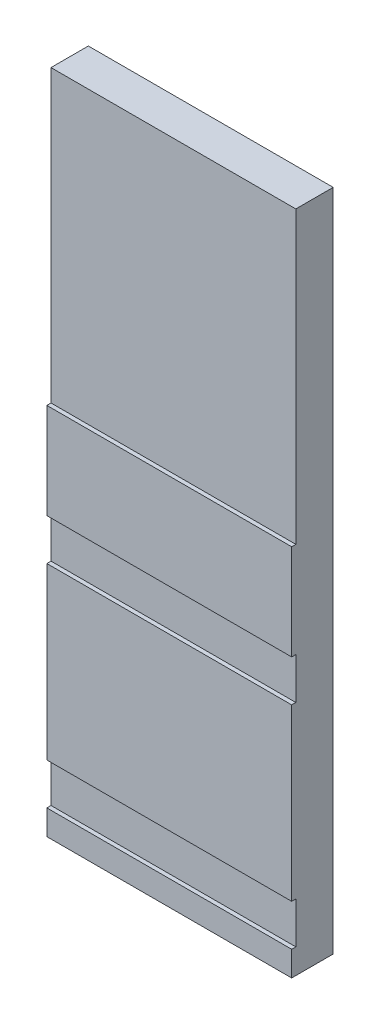
ISO-10303-21;
HEADER;
FILE_DESCRIPTION(('STEP AP214'),'2;1');
FILE_NAME('part.step','',(''),(''),'','','');
FILE_SCHEMA(('AUTOMOTIVE_DESIGN { 1 0 10303 214 1 1 1 1 }'));
ENDSEC;
DATA;
#1=APPLICATION_CONTEXT('core data for automotive mechanical design processes');
#2=APPLICATION_PROTOCOL_DEFINITION('international standard','automotive_design',2000,#1);
#3=PRODUCT_CONTEXT('',#1,'mechanical');
#4=PRODUCT('Part','Part','',(#3));
#5=PRODUCT_RELATED_PRODUCT_CATEGORY('part','',(#4));
#6=PRODUCT_DEFINITION_FORMATION('','',#4);
#7=PRODUCT_DEFINITION_CONTEXT('part definition',#1,'design');
#8=PRODUCT_DEFINITION('design','',#6,#7);
#9=PRODUCT_DEFINITION_SHAPE('','',#8);
#10=(LENGTH_UNIT() NAMED_UNIT(*) SI_UNIT(.MILLI.,.METRE.));
#11=(NAMED_UNIT(*) PLANE_ANGLE_UNIT() SI_UNIT($,.RADIAN.));
#12=(NAMED_UNIT(*) SI_UNIT($,.STERADIAN.) SOLID_ANGLE_UNIT());
#13=UNCERTAINTY_MEASURE_WITH_UNIT(LENGTH_MEASURE(1.E-05),#10,'distance_accuracy_value','');
#14=(GEOMETRIC_REPRESENTATION_CONTEXT(3) GLOBAL_UNCERTAINTY_ASSIGNED_CONTEXT((#13)) GLOBAL_UNIT_ASSIGNED_CONTEXT((#10,
#11,#12)) REPRESENTATION_CONTEXT('',''));
#15=CARTESIAN_POINT('',(0.,0.,0.));
#16=DIRECTION('',(0.,0.,1.));
#17=DIRECTION('',(1.,0.,0.));
#18=AXIS2_PLACEMENT_3D('',#15,#16,#17);
#19=CARTESIAN_POINT('',(-45.5342388668519,0.,10.));
#20=DIRECTION('',(1.,0.,0.));
#21=DIRECTION('',(0.,1.,0.));
#22=AXIS2_PLACEMENT_3D('',#19,#20,#21);
#23=PLANE('',#22);
#24=DIRECTION('',(0.,-1.,0.));
#25=VECTOR('',#24,1.);
#26=CARTESIAN_POINT('',(-45.5342388668519,0.,0.));
#27=LINE('',#26,#25);
#28=CARTESIAN_POINT('',(-45.5342388668519,52.8569965793573,0.));
#29=VERTEX_POINT('',#28);
#30=CARTESIAN_POINT('',(-45.5342388668519,-107.143003420643,0.));
#31=VERTEX_POINT('',#30);
#32=EDGE_CURVE('E319',#29,#31,#27,.T.);
#33=ORIENTED_EDGE('',*,*,#32,.T.);
#34=DIRECTION('',(0.,0.,-1.));
#35=VECTOR('',#34,1.);
#36=CARTESIAN_POINT('',(-45.5342388668519,-107.143003420643,10.));
#37=LINE('',#36,#35);
#38=CARTESIAN_POINT('',(-45.5342388668519,-107.143003420643,10.));
#39=VERTEX_POINT('',#38);
#40=EDGE_CURVE('E172',#39,#31,#37,.T.);
#41=ORIENTED_EDGE('',*,*,#40,.F.);
#42=DIRECTION('',(0.,-1.,0.));
#43=VECTOR('',#42,1.);
#44=CARTESIAN_POINT('',(-45.5342388668519,0.,10.));
#45=LINE('',#44,#43);
#46=CARTESIAN_POINT('',(-45.5342388668519,-101.143003420643,10.));
#47=VERTEX_POINT('',#46);
#48=EDGE_CURVE('E157',#47,#39,#45,.T.);
#49=ORIENTED_EDGE('',*,*,#48,.F.);
#50=DIRECTION('',(0.,0.,-1.));
#51=VECTOR('',#50,1.);
#52=CARTESIAN_POINT('',(-45.5342388668519,-101.143003420643,10.));
#53=LINE('',#52,#51);
#54=CARTESIAN_POINT('',(-45.5342388668519,-101.143003420643,9.));
#55=VERTEX_POINT('',#54);
#56=EDGE_CURVE('E149',#47,#55,#53,.T.);
#57=ORIENTED_EDGE('',*,*,#56,.T.);
#58=DIRECTION('',(0.,-1.,0.));
#59=VECTOR('',#58,1.);
#60=CARTESIAN_POINT('',(-45.5342388668519,0.,9.));
#61=LINE('',#60,#59);
#62=CARTESIAN_POINT('',(-45.5342388668519,-91.1430034206427,9.));
#63=VERTEX_POINT('',#62);
#64=EDGE_CURVE('E189',#63,#55,#61,.T.);
#65=ORIENTED_EDGE('',*,*,#64,.F.);
#66=DIRECTION('',(0.,0.,-1.));
#67=VECTOR('',#66,1.);
#68=CARTESIAN_POINT('',(-45.5342388668519,-91.1430034206427,10.));
#69=LINE('',#68,#67);
#70=CARTESIAN_POINT('',(-45.5342388668519,-91.1430034206427,10.));
#71=VERTEX_POINT('',#70);
#72=EDGE_CURVE('E190',#71,#63,#69,.T.);
#73=ORIENTED_EDGE('',*,*,#72,.F.);
#74=DIRECTION('',(0.,-1.,0.));
#75=VECTOR('',#74,1.);
#76=CARTESIAN_POINT('',(-45.5342388668519,0.,10.));
#77=LINE('',#76,#75);
#78=CARTESIAN_POINT('',(-45.5342388668519,-50.1430034206427,10.));
#79=VERTEX_POINT('',#78);
#80=EDGE_CURVE('E183',#79,#71,#77,.T.);
#81=ORIENTED_EDGE('',*,*,#80,.F.);
#82=DIRECTION('',(0.,0.,-1.));
#83=VECTOR('',#82,1.);
#84=CARTESIAN_POINT('',(-45.5342388668519,-50.1430034206427,10.));
#85=LINE('',#84,#83);
#86=CARTESIAN_POINT('',(-45.5342388668519,-50.1430034206427,9.));
#87=VERTEX_POINT('',#86);
#88=EDGE_CURVE('E210',#79,#87,#85,.T.);
#89=ORIENTED_EDGE('',*,*,#88,.T.);
#90=DIRECTION('',(0.,-1.,0.));
#91=VECTOR('',#90,1.);
#92=CARTESIAN_POINT('',(-45.5342388668519,0.,9.));
#93=LINE('',#92,#91);
#94=CARTESIAN_POINT('',(-45.5342388668519,-40.1430034206427,9.));
#95=VERTEX_POINT('',#94);
#96=EDGE_CURVE('E297',#95,#87,#93,.T.);
#97=ORIENTED_EDGE('',*,*,#96,.F.);
#98=DIRECTION('',(0.,0.,-1.));
#99=VECTOR('',#98,1.);
#100=CARTESIAN_POINT('',(-45.5342388668519,-40.1430034206427,10.));
#101=LINE('',#100,#99);
#102=CARTESIAN_POINT('',(-45.5342388668519,-40.1430034206427,10.));
#103=VERTEX_POINT('',#102);
#104=EDGE_CURVE('E11',#103,#95,#101,.T.);
#105=ORIENTED_EDGE('',*,*,#104,.F.);
#106=DIRECTION('',(0.,-1.,0.));
#107=VECTOR('',#106,1.);
#108=CARTESIAN_POINT('',(-45.5342388668519,0.,10.));
#109=LINE('',#108,#107);
#110=CARTESIAN_POINT('',(-45.5342388668519,-17.1430034206427,10.));
#111=VERTEX_POINT('',#110);
#112=EDGE_CURVE('E320',#111,#103,#109,.T.);
#113=ORIENTED_EDGE('',*,*,#112,.F.);
#114=DIRECTION('',(0.,0.,-1.));
#115=VECTOR('',#114,1.);
#116=CARTESIAN_POINT('',(-45.5342388668519,-17.1430034206427,10.));
#117=LINE('',#116,#115);
#118=CARTESIAN_POINT('',(-45.5342388668519,-17.1430034206427,9.));
#119=VERTEX_POINT('',#118);
#120=EDGE_CURVE('E331',#111,#119,#117,.T.);
#121=ORIENTED_EDGE('',*,*,#120,.T.);
#122=DIRECTION('',(0.,-1.,0.));
#123=VECTOR('',#122,1.);
#124=CARTESIAN_POINT('',(-45.5342388668519,0.,9.));
#125=LINE('',#124,#123);
#126=CARTESIAN_POINT('',(-45.5342388668519,52.8569965793573,9.));
#127=VERTEX_POINT('',#126);
#128=EDGE_CURVE('E346',#127,#119,#125,.T.);
#129=ORIENTED_EDGE('',*,*,#128,.F.);
#130=DIRECTION('',(0.,0.,-1.));
#131=VECTOR('',#130,1.);
#132=CARTESIAN_POINT('',(-45.5342388668519,52.8569965793573,9.));
#133=LINE('',#132,#131);
#134=EDGE_CURVE('E312',#127,#29,#133,.T.);
#135=ORIENTED_EDGE('',*,*,#134,.T.);
#136=EDGE_LOOP('',(#33,#41,#49,#57,#65,#73,#81,#89,#97,#105,#113,#121,#129,#135));
#137=FACE_BOUND('',#136,.T.);
#138=ADVANCED_FACE('F35',(#137),#23,.F.);
#139=CARTESIAN_POINT('',(0.,-40.1430034206427,10.));
#140=DIRECTION('',(0.,1.,0.));
#141=DIRECTION('',(-1.,0.,0.));
#142=AXIS2_PLACEMENT_3D('',#139,#140,#141);
#143=PLANE('',#142);
#144=ORIENTED_EDGE('',*,*,#104,.T.);
#145=DIRECTION('',(1.,0.,0.));
#146=VECTOR('',#145,1.);
#147=CARTESIAN_POINT('',(0.,-40.1430034206427,9.));
#148=LINE('',#147,#146);
#149=CARTESIAN_POINT('',(13.4657611331481,-40.1430034206427,9.));
#150=VERTEX_POINT('',#149);
#151=EDGE_CURVE('E295',#95,#150,#148,.T.);
#152=ORIENTED_EDGE('',*,*,#151,.T.);
#153=DIRECTION('',(0.,0.,-1.));
#154=VECTOR('',#153,1.);
#155=CARTESIAN_POINT('',(13.4657611331481,-40.1430034206427,10.));
#156=LINE('',#155,#154);
#157=CARTESIAN_POINT('',(13.4657611331481,-40.1430034206427,10.));
#158=VERTEX_POINT('',#157);
#159=EDGE_CURVE('E44',#158,#150,#156,.T.);
#160=ORIENTED_EDGE('',*,*,#159,.F.);
#161=DIRECTION('',(1.,0.,0.));
#162=VECTOR('',#161,1.);
#163=CARTESIAN_POINT('',(0.,-40.1430034206427,10.));
#164=LINE('',#163,#162);
#165=EDGE_CURVE('E323',#103,#158,#164,.T.);
#166=ORIENTED_EDGE('',*,*,#165,.F.);
#167=EDGE_LOOP('',(#144,#152,#160,#166));
#168=FACE_BOUND('',#167,.T.);
#169=ADVANCED_FACE('F250',(#168),#143,.F.);
#170=CARTESIAN_POINT('',(13.4657611331481,0.,10.));
#171=DIRECTION('',(1.,0.,0.));
#172=DIRECTION('',(0.,1.,0.));
#173=AXIS2_PLACEMENT_3D('',#170,#171,#172);
#174=PLANE('',#173);
#175=DIRECTION('',(0.,-1.,0.));
#176=VECTOR('',#175,1.);
#177=CARTESIAN_POINT('',(13.4657611331481,0.,0.));
#178=LINE('',#177,#176);
#179=CARTESIAN_POINT('',(13.4657611331481,52.8569965793573,0.));
#180=VERTEX_POINT('',#179);
#181=CARTESIAN_POINT('',(13.4657611331481,-107.143003420643,0.));
#182=VERTEX_POINT('',#181);
#183=EDGE_CURVE('E324',#180,#182,#178,.T.);
#184=ORIENTED_EDGE('',*,*,#183,.F.);
#185=DIRECTION('',(0.,0.,-1.));
#186=VECTOR('',#185,1.);
#187=CARTESIAN_POINT('',(13.4657611331481,52.8569965793573,9.));
#188=LINE('',#187,#186);
#189=CARTESIAN_POINT('',(13.4657611331481,52.8569965793573,9.));
#190=VERTEX_POINT('',#189);
#191=EDGE_CURVE('E315',#190,#180,#188,.T.);
#192=ORIENTED_EDGE('',*,*,#191,.F.);
#193=DIRECTION('',(0.,-1.,0.));
#194=VECTOR('',#193,1.);
#195=CARTESIAN_POINT('',(13.4657611331481,0.,9.));
#196=LINE('',#195,#194);
#197=CARTESIAN_POINT('',(13.4657611331481,-17.1430034206427,9.));
#198=VERTEX_POINT('',#197);
#199=EDGE_CURVE('E303',#190,#198,#196,.T.);
#200=ORIENTED_EDGE('',*,*,#199,.T.);
#201=DIRECTION('',(0.,0.,-1.));
#202=VECTOR('',#201,1.);
#203=CARTESIAN_POINT('',(13.4657611331481,-17.1430034206427,10.));
#204=LINE('',#203,#202);
#205=CARTESIAN_POINT('',(13.4657611331481,-17.1430034206427,10.));
#206=VERTEX_POINT('',#205);
#207=EDGE_CURVE('E342',#206,#198,#204,.T.);
#208=ORIENTED_EDGE('',*,*,#207,.F.);
#209=DIRECTION('',(0.,-1.,0.));
#210=VECTOR('',#209,1.);
#211=CARTESIAN_POINT('',(13.4657611331481,0.,10.));
#212=LINE('',#211,#210);
#213=EDGE_CURVE('E326',#206,#158,#212,.T.);
#214=ORIENTED_EDGE('',*,*,#213,.T.);
#215=ORIENTED_EDGE('',*,*,#159,.T.);
#216=DIRECTION('',(0.,-1.,0.));
#217=VECTOR('',#216,1.);
#218=CARTESIAN_POINT('',(13.4657611331481,0.,9.));
#219=LINE('',#218,#217);
#220=CARTESIAN_POINT('',(13.4657611331481,-50.1430034206427,9.));
#221=VERTEX_POINT('',#220);
#222=EDGE_CURVE('E60',#150,#221,#219,.T.);
#223=ORIENTED_EDGE('',*,*,#222,.T.);
#224=DIRECTION('',(0.,0.,-1.));
#225=VECTOR('',#224,1.);
#226=CARTESIAN_POINT('',(13.4657611331481,-50.1430034206427,10.));
#227=LINE('',#226,#225);
#228=CARTESIAN_POINT('',(13.4657611331481,-50.1430034206427,10.));
#229=VERTEX_POINT('',#228);
#230=EDGE_CURVE('E218',#229,#221,#227,.T.);
#231=ORIENTED_EDGE('',*,*,#230,.F.);
#232=DIRECTION('',(0.,-1.,0.));
#233=VECTOR('',#232,1.);
#234=CARTESIAN_POINT('',(13.4657611331481,0.,10.));
#235=LINE('',#234,#233);
#236=CARTESIAN_POINT('',(13.4657611331481,-91.1430034206427,10.));
#237=VERTEX_POINT('',#236);
#238=EDGE_CURVE('E202',#229,#237,#235,.T.);
#239=ORIENTED_EDGE('',*,*,#238,.T.);
#240=DIRECTION('',(0.,0.,-1.));
#241=VECTOR('',#240,1.);
#242=CARTESIAN_POINT('',(13.4657611331481,-91.1430034206427,10.));
#243=LINE('',#242,#241);
#244=CARTESIAN_POINT('',(13.4657611331481,-91.1430034206427,9.));
#245=VERTEX_POINT('',#244);
#246=EDGE_CURVE('E222',#237,#245,#243,.T.);
#247=ORIENTED_EDGE('',*,*,#246,.T.);
#248=DIRECTION('',(0.,-1.,0.));
#249=VECTOR('',#248,1.);
#250=CARTESIAN_POINT('',(13.4657611331481,0.,9.));
#251=LINE('',#250,#249);
#252=CARTESIAN_POINT('',(13.4657611331481,-101.143003420643,9.));
#253=VERTEX_POINT('',#252);
#254=EDGE_CURVE('E52',#245,#253,#251,.T.);
#255=ORIENTED_EDGE('',*,*,#254,.T.);
#256=DIRECTION('',(0.,0.,-1.));
#257=VECTOR('',#256,1.);
#258=CARTESIAN_POINT('',(13.4657611331481,-101.143003420643,10.));
#259=LINE('',#258,#257);
#260=CARTESIAN_POINT('',(13.4657611331481,-101.143003420643,10.));
#261=VERTEX_POINT('',#260);
#262=EDGE_CURVE('E140',#261,#253,#259,.T.);
#263=ORIENTED_EDGE('',*,*,#262,.F.);
#264=DIRECTION('',(0.,-1.,0.));
#265=VECTOR('',#264,1.);
#266=CARTESIAN_POINT('',(13.4657611331481,0.,10.));
#267=LINE('',#266,#265);
#268=CARTESIAN_POINT('',(13.4657611331481,-107.143003420643,10.));
#269=VERTEX_POINT('',#268);
#270=EDGE_CURVE('E145',#261,#269,#267,.T.);
#271=ORIENTED_EDGE('',*,*,#270,.T.);
#272=DIRECTION('',(0.,0.,-1.));
#273=VECTOR('',#272,1.);
#274=CARTESIAN_POINT('',(13.4657611331481,-107.143003420643,10.));
#275=LINE('',#274,#273);
#276=EDGE_CURVE('E169',#269,#182,#275,.T.);
#277=ORIENTED_EDGE('',*,*,#276,.T.);
#278=EDGE_LOOP('',(#184,#192,#200,#208,#214,#215,#223,#231,#239,#247,#255,#263,#271,#277));
#279=FACE_BOUND('',#278,.T.);
#280=ADVANCED_FACE('F142',(#279),#174,.T.);
#281=CARTESIAN_POINT('',(0.,-17.1430034206427,10.));
#282=DIRECTION('',(0.,1.,0.));
#283=DIRECTION('',(-1.,0.,0.));
#284=AXIS2_PLACEMENT_3D('',#281,#282,#283);
#285=PLANE('',#284);
#286=DIRECTION('',(1.,0.,0.));
#287=VECTOR('',#286,1.);
#288=CARTESIAN_POINT('',(0.,-17.1430034206427,9.));
#289=LINE('',#288,#287);
#290=EDGE_CURVE('E316',#119,#198,#289,.T.);
#291=ORIENTED_EDGE('',*,*,#290,.F.);
#292=ORIENTED_EDGE('',*,*,#120,.F.);
#293=DIRECTION('',(1.,0.,0.));
#294=VECTOR('',#293,1.);
#295=CARTESIAN_POINT('',(0.,-17.1430034206427,10.));
#296=LINE('',#295,#294);
#297=EDGE_CURVE('E328',#111,#206,#296,.T.);
#298=ORIENTED_EDGE('',*,*,#297,.T.);
#299=ORIENTED_EDGE('',*,*,#207,.T.);
#300=EDGE_LOOP('',(#291,#292,#298,#299));
#301=FACE_BOUND('',#300,.T.);
#302=ADVANCED_FACE('F258',(#301),#285,.T.);
#303=CARTESIAN_POINT('',(0.,0.,10.));
#304=DIRECTION('',(0.,0.,1.));
#305=DIRECTION('',(1.,0.,0.));
#306=AXIS2_PLACEMENT_3D('',#303,#304,#305);
#307=PLANE('',#306);
#308=ORIENTED_EDGE('',*,*,#112,.T.);
#309=ORIENTED_EDGE('',*,*,#165,.T.);
#310=ORIENTED_EDGE('',*,*,#213,.F.);
#311=ORIENTED_EDGE('',*,*,#297,.F.);
#312=EDGE_LOOP('',(#308,#309,#310,#311));
#313=FACE_BOUND('',#312,.T.);
#314=ADVANCED_FACE('F263',(#313),#307,.T.);
#315=CARTESIAN_POINT('',(0.,0.,0.));
#316=DIRECTION('',(0.,0.,1.));
#317=DIRECTION('',(1.,0.,0.));
#318=AXIS2_PLACEMENT_3D('',#315,#316,#317);
#319=PLANE('',#318);
#320=ORIENTED_EDGE('',*,*,#32,.F.);
#321=DIRECTION('',(1.,0.,0.));
#322=VECTOR('',#321,1.);
#323=CARTESIAN_POINT('',(0.,52.8569965793573,0.));
#324=LINE('',#323,#322);
#325=EDGE_CURVE('E301',#29,#180,#324,.T.);
#326=ORIENTED_EDGE('',*,*,#325,.T.);
#327=ORIENTED_EDGE('',*,*,#183,.T.);
#328=DIRECTION('',(1.,0.,0.));
#329=VECTOR('',#328,1.);
#330=CARTESIAN_POINT('',(0.,-107.143003420643,0.));
#331=LINE('',#330,#329);
#332=EDGE_CURVE('E163',#31,#182,#331,.T.);
#333=ORIENTED_EDGE('',*,*,#332,.F.);
#334=EDGE_LOOP('',(#320,#326,#327,#333));
#335=FACE_BOUND('',#334,.T.);
#336=ADVANCED_FACE('F265',(#335),#319,.F.);
#337=CARTESIAN_POINT('',(0.,52.8569965793573,9.));
#338=DIRECTION('',(0.,1.,0.));
#339=DIRECTION('',(0.,0.,1.));
#340=AXIS2_PLACEMENT_3D('',#337,#338,#339);
#341=PLANE('',#340);
#342=ORIENTED_EDGE('',*,*,#325,.F.);
#343=ORIENTED_EDGE('',*,*,#134,.F.);
#344=DIRECTION('',(1.,0.,0.));
#345=VECTOR('',#344,1.);
#346=CARTESIAN_POINT('',(0.,52.8569965793573,9.));
#347=LINE('',#346,#345);
#348=EDGE_CURVE('E307',#127,#190,#347,.T.);
#349=ORIENTED_EDGE('',*,*,#348,.T.);
#350=ORIENTED_EDGE('',*,*,#191,.T.);
#351=EDGE_LOOP('',(#342,#343,#349,#350));
#352=FACE_BOUND('',#351,.T.);
#353=ADVANCED_FACE('F268',(#352),#341,.T.);
#354=CARTESIAN_POINT('',(0.,0.,9.));
#355=DIRECTION('',(0.,0.,1.));
#356=DIRECTION('',(1.,0.,0.));
#357=AXIS2_PLACEMENT_3D('',#354,#355,#356);
#358=PLANE('',#357);
#359=ORIENTED_EDGE('',*,*,#199,.F.);
#360=ORIENTED_EDGE('',*,*,#348,.F.);
#361=ORIENTED_EDGE('',*,*,#128,.T.);
#362=ORIENTED_EDGE('',*,*,#290,.T.);
#363=EDGE_LOOP('',(#359,#360,#361,#362));
#364=FACE_BOUND('',#363,.T.);
#365=ADVANCED_FACE('F275',(#364),#358,.T.);
#366=CARTESIAN_POINT('',(0.,0.,9.));
#367=DIRECTION('',(0.,0.,1.));
#368=DIRECTION('',(1.,0.,0.));
#369=AXIS2_PLACEMENT_3D('',#366,#367,#368);
#370=PLANE('',#369);
#371=DIRECTION('',(-1.,0.,0.));
#372=VECTOR('',#371,1.);
#373=CARTESIAN_POINT('',(0.,-50.1430034206427,9.));
#374=LINE('',#373,#372);
#375=EDGE_CURVE('E228',#221,#87,#374,.T.);
#376=ORIENTED_EDGE('',*,*,#375,.F.);
#377=ORIENTED_EDGE('',*,*,#222,.F.);
#378=ORIENTED_EDGE('',*,*,#151,.F.);
#379=ORIENTED_EDGE('',*,*,#96,.T.);
#380=EDGE_LOOP('',(#376,#377,#378,#379));
#381=FACE_BOUND('',#380,.T.);
#382=ADVANCED_FACE('F279',(#381),#370,.T.);
#383=CARTESIAN_POINT('',(0.,-50.1430034206427,10.));
#384=DIRECTION('',(0.,-1.,0.));
#385=DIRECTION('',(1.,0.,0.));
#386=AXIS2_PLACEMENT_3D('',#383,#384,#385);
#387=PLANE('',#386);
#388=ORIENTED_EDGE('',*,*,#230,.T.);
#389=ORIENTED_EDGE('',*,*,#375,.T.);
#390=ORIENTED_EDGE('',*,*,#88,.F.);
#391=DIRECTION('',(-1.,0.,0.));
#392=VECTOR('',#391,1.);
#393=CARTESIAN_POINT('',(0.,-50.1430034206427,10.));
#394=LINE('',#393,#392);
#395=EDGE_CURVE('E206',#229,#79,#394,.T.);
#396=ORIENTED_EDGE('',*,*,#395,.F.);
#397=EDGE_LOOP('',(#388,#389,#390,#396));
#398=FACE_BOUND('',#397,.T.);
#399=ADVANCED_FACE('F283',(#398),#387,.F.);
#400=CARTESIAN_POINT('',(0.,-91.1430034206427,10.));
#401=DIRECTION('',(0.,1.,0.));
#402=DIRECTION('',(-1.,0.,0.));
#403=AXIS2_PLACEMENT_3D('',#400,#401,#402);
#404=PLANE('',#403);
#405=ORIENTED_EDGE('',*,*,#72,.T.);
#406=DIRECTION('',(1.,0.,0.));
#407=VECTOR('',#406,1.);
#408=CARTESIAN_POINT('',(0.,-91.1430034206427,9.));
#409=LINE('',#408,#407);
#410=EDGE_CURVE('E186',#63,#245,#409,.T.);
#411=ORIENTED_EDGE('',*,*,#410,.T.);
#412=ORIENTED_EDGE('',*,*,#246,.F.);
#413=DIRECTION('',(1.,0.,0.));
#414=VECTOR('',#413,1.);
#415=CARTESIAN_POINT('',(0.,-91.1430034206427,10.));
#416=LINE('',#415,#414);
#417=EDGE_CURVE('E198',#71,#237,#416,.T.);
#418=ORIENTED_EDGE('',*,*,#417,.F.);
#419=EDGE_LOOP('',(#405,#411,#412,#418));
#420=FACE_BOUND('',#419,.T.);
#421=ADVANCED_FACE('F236',(#420),#404,.F.);
#422=CARTESIAN_POINT('',(0.,0.,10.));
#423=DIRECTION('',(0.,0.,1.));
#424=DIRECTION('',(1.,0.,0.));
#425=AXIS2_PLACEMENT_3D('',#422,#423,#424);
#426=PLANE('',#425);
#427=ORIENTED_EDGE('',*,*,#80,.T.);
#428=ORIENTED_EDGE('',*,*,#417,.T.);
#429=ORIENTED_EDGE('',*,*,#238,.F.);
#430=ORIENTED_EDGE('',*,*,#395,.T.);
#431=EDGE_LOOP('',(#427,#428,#429,#430));
#432=FACE_BOUND('',#431,.T.);
#433=ADVANCED_FACE('F240',(#432),#426,.T.);
#434=CARTESIAN_POINT('',(0.,0.,9.));
#435=DIRECTION('',(0.,0.,1.));
#436=DIRECTION('',(1.,0.,0.));
#437=AXIS2_PLACEMENT_3D('',#434,#435,#436);
#438=PLANE('',#437);
#439=DIRECTION('',(-1.,0.,0.));
#440=VECTOR('',#439,1.);
#441=CARTESIAN_POINT('',(0.,-101.143003420643,9.));
#442=LINE('',#441,#440);
#443=EDGE_CURVE('E38',#253,#55,#442,.T.);
#444=ORIENTED_EDGE('',*,*,#443,.F.);
#445=ORIENTED_EDGE('',*,*,#254,.F.);
#446=ORIENTED_EDGE('',*,*,#410,.F.);
#447=ORIENTED_EDGE('',*,*,#64,.T.);
#448=EDGE_LOOP('',(#444,#445,#446,#447));
#449=FACE_BOUND('',#448,.T.);
#450=ADVANCED_FACE('F238',(#449),#438,.T.);
#451=CARTESIAN_POINT('',(0.,-101.143003420643,10.));
#452=DIRECTION('',(0.,-1.,0.));
#453=DIRECTION('',(1.,0.,0.));
#454=AXIS2_PLACEMENT_3D('',#451,#452,#453);
#455=PLANE('',#454);
#456=ORIENTED_EDGE('',*,*,#262,.T.);
#457=ORIENTED_EDGE('',*,*,#443,.T.);
#458=ORIENTED_EDGE('',*,*,#56,.F.);
#459=DIRECTION('',(-1.,0.,0.));
#460=VECTOR('',#459,1.);
#461=CARTESIAN_POINT('',(0.,-101.143003420643,10.));
#462=LINE('',#461,#460);
#463=EDGE_CURVE('E152',#261,#47,#462,.T.);
#464=ORIENTED_EDGE('',*,*,#463,.F.);
#465=EDGE_LOOP('',(#456,#457,#458,#464));
#466=FACE_BOUND('',#465,.T.);
#467=ADVANCED_FACE('F153',(#466),#455,.F.);
#468=CARTESIAN_POINT('',(0.,-107.143003420643,10.));
#469=DIRECTION('',(0.,1.,0.));
#470=DIRECTION('',(0.,0.,1.));
#471=AXIS2_PLACEMENT_3D('',#468,#469,#470);
#472=PLANE('',#471);
#473=ORIENTED_EDGE('',*,*,#332,.T.);
#474=ORIENTED_EDGE('',*,*,#276,.F.);
#475=DIRECTION('',(1.,0.,0.));
#476=VECTOR('',#475,1.);
#477=CARTESIAN_POINT('',(0.,-107.143003420643,10.));
#478=LINE('',#477,#476);
#479=EDGE_CURVE('E161',#39,#269,#478,.T.);
#480=ORIENTED_EDGE('',*,*,#479,.F.);
#481=ORIENTED_EDGE('',*,*,#40,.T.);
#482=EDGE_LOOP('',(#473,#474,#480,#481));
#483=FACE_BOUND('',#482,.T.);
#484=ADVANCED_FACE('F246',(#483),#472,.F.);
#485=CARTESIAN_POINT('',(0.,0.,10.));
#486=DIRECTION('',(0.,0.,1.));
#487=DIRECTION('',(1.,0.,0.));
#488=AXIS2_PLACEMENT_3D('',#485,#486,#487);
#489=PLANE('',#488);
#490=ORIENTED_EDGE('',*,*,#270,.F.);
#491=ORIENTED_EDGE('',*,*,#463,.T.);
#492=ORIENTED_EDGE('',*,*,#48,.T.);
#493=ORIENTED_EDGE('',*,*,#479,.T.);
#494=EDGE_LOOP('',(#490,#491,#492,#493));
#495=FACE_BOUND('',#494,.T.);
#496=ADVANCED_FACE('F159',(#495),#489,.T.);
#497=CLOSED_SHELL('',(#138,#169,#280,#302,#314,#336,#353,#365,#382,#399,#421,#433,#450,#467,
#484,#496));
#498=MANIFOLD_SOLID_BREP('B2',#497);
#499=ADVANCED_BREP_SHAPE_REPRESENTATION('',(#18,#498),#14);
#500=SHAPE_DEFINITION_REPRESENTATION(#9,#499);
ENDSEC;
END-ISO-10303-21;
